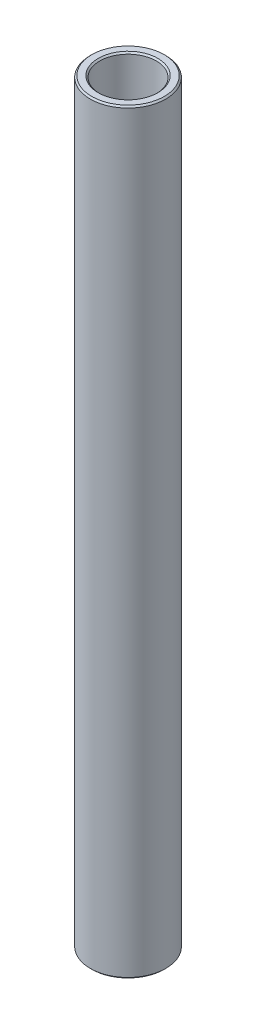
ISO-10303-21;
HEADER;
FILE_DESCRIPTION(('STEP AP214'),'2;1');
FILE_NAME('part.step','',(''),(''),'','','');
FILE_SCHEMA(('AUTOMOTIVE_DESIGN { 1 0 10303 214 1 1 1 1 }'));
ENDSEC;
DATA;
#1=APPLICATION_CONTEXT('core data for automotive mechanical design processes');
#2=APPLICATION_PROTOCOL_DEFINITION('international standard','automotive_design',2000,#1);
#3=PRODUCT_CONTEXT('',#1,'mechanical');
#4=PRODUCT('Part','Part','',(#3));
#5=PRODUCT_RELATED_PRODUCT_CATEGORY('part','',(#4));
#6=PRODUCT_DEFINITION_FORMATION('','',#4);
#7=PRODUCT_DEFINITION_CONTEXT('part definition',#1,'design');
#8=PRODUCT_DEFINITION('design','',#6,#7);
#9=PRODUCT_DEFINITION_SHAPE('','',#8);
#10=(LENGTH_UNIT() NAMED_UNIT(*) SI_UNIT(.MILLI.,.METRE.));
#11=(NAMED_UNIT(*) PLANE_ANGLE_UNIT() SI_UNIT($,.RADIAN.));
#12=(NAMED_UNIT(*) SI_UNIT($,.STERADIAN.) SOLID_ANGLE_UNIT());
#13=UNCERTAINTY_MEASURE_WITH_UNIT(LENGTH_MEASURE(1.E-05),#10,'distance_accuracy_value','');
#14=(GEOMETRIC_REPRESENTATION_CONTEXT(3) GLOBAL_UNCERTAINTY_ASSIGNED_CONTEXT((#13)) GLOBAL_UNIT_ASSIGNED_CONTEXT((#10,
#11,#12)) REPRESENTATION_CONTEXT('',''));
#15=CARTESIAN_POINT('',(0.,0.,0.));
#16=DIRECTION('',(0.,0.,1.));
#17=DIRECTION('',(1.,0.,0.));
#18=AXIS2_PLACEMENT_3D('',#15,#16,#17);
#19=CARTESIAN_POINT('',(6.35000000000029,70.6436949648141,0.));
#20=DIRECTION('',(0.,-1.,0.));
#21=DIRECTION('',(1.,0.,0.));
#22=AXIS2_PLACEMENT_3D('',#19,#20,#21);
#23=PLANE('',#22);
#24=CARTESIAN_POINT('',(0.,70.6436949648141,0.));
#25=DIRECTION('',(0.,-1.,0.));
#26=DIRECTION('',(1.,0.,0.));
#27=AXIS2_PLACEMENT_3D('',#24,#25,#26);
#28=CIRCLE('',#27,5.01649999999998);
#29=CARTESIAN_POINT('',(5.01649999999997,70.6436949648141,0.));
#30=VERTEX_POINT('',#29);
#31=EDGE_CURVE('E10',#30,#30,#28,.F.);
#32=ORIENTED_EDGE('',*,*,#31,.T.);
#33=EDGE_LOOP('',(#32));
#34=FACE_BOUND('',#33,.T.);
#35=CARTESIAN_POINT('',(0.,70.6436949648141,0.));
#36=DIRECTION('',(0.,-1.,0.));
#37=DIRECTION('',(1.,0.,0.));
#38=AXIS2_PLACEMENT_3D('',#35,#36,#37);
#39=CIRCLE('',#38,6.09600000000031);
#40=CARTESIAN_POINT('',(6.0960000000003,70.6436949648141,0.));
#41=VERTEX_POINT('',#40);
#42=EDGE_CURVE('E38',#41,#41,#39,.T.);
#43=ORIENTED_EDGE('',*,*,#42,.T.);
#44=EDGE_LOOP('',(#43));
#45=FACE_BOUND('',#44,.T.);
#46=ADVANCED_FACE('F31',(#34,#45),#23,.T.);
#47=CARTESIAN_POINT('',(0.,61.1186949648141,0.));
#48=DIRECTION('',(0.,-1.,0.));
#49=DIRECTION('',(1.,0.,0.));
#50=AXIS2_PLACEMENT_3D('',#47,#48,#49);
#51=CYLINDRICAL_SURFACE('',#50,4.76250000000008);
#52=CARTESIAN_POINT('',(-1.16547916277586E-13,197.576828412297,0.));
#53=DIRECTION('',(0.,1.,0.));
#54=DIRECTION('',(-1.,0.,0.));
#55=AXIS2_PLACEMENT_3D('',#52,#53,#54);
#56=CIRCLE('',#55,4.76250000000008);
#57=CARTESIAN_POINT('',(-4.76250000000019,197.576828412297,0.));
#58=VERTEX_POINT('',#57);
#59=EDGE_CURVE('E42',#58,#58,#56,.T.);
#60=ORIENTED_EDGE('',*,*,#59,.T.);
#61=EDGE_LOOP('',(#60));
#62=FACE_BOUND('',#61,.T.);
#63=CARTESIAN_POINT('',(0.,70.897694964814,0.));
#64=DIRECTION('',(0.,-1.,0.));
#65=DIRECTION('',(1.,0.,0.));
#66=AXIS2_PLACEMENT_3D('',#63,#64,#65);
#67=CIRCLE('',#66,4.76250000000008);
#68=CARTESIAN_POINT('',(4.76250000000007,70.897694964814,0.));
#69=VERTEX_POINT('',#68);
#70=EDGE_CURVE('E46',#69,#69,#67,.T.);
#71=ORIENTED_EDGE('',*,*,#70,.T.);
#72=EDGE_LOOP('',(#71));
#73=FACE_BOUND('',#72,.T.);
#74=ADVANCED_FACE('F75',(#62,#73),#51,.F.);
#75=CARTESIAN_POINT('',(4.76250000000001,197.830828412297,0.));
#76=DIRECTION('',(0.,1.,0.));
#77=DIRECTION('',(-1.,0.,0.));
#78=AXIS2_PLACEMENT_3D('',#75,#76,#77);
#79=PLANE('',#78);
#80=CARTESIAN_POINT('',(-1.16764855861813E-13,197.830828412297,0.));
#81=DIRECTION('',(0.,1.,0.));
#82=DIRECTION('',(-1.,0.,0.));
#83=AXIS2_PLACEMENT_3D('',#80,#81,#82);
#84=CIRCLE('',#83,6.09600000000043);
#85=CARTESIAN_POINT('',(-6.09600000000055,197.830828412297,0.));
#86=VERTEX_POINT('',#85);
#87=EDGE_CURVE('E51',#86,#86,#84,.T.);
#88=ORIENTED_EDGE('',*,*,#87,.T.);
#89=EDGE_LOOP('',(#88));
#90=FACE_BOUND('',#89,.T.);
#91=CARTESIAN_POINT('',(-1.16764855861813E-13,197.830828412297,0.));
#92=DIRECTION('',(0.,1.,0.));
#93=DIRECTION('',(-1.,0.,0.));
#94=AXIS2_PLACEMENT_3D('',#91,#92,#93);
#95=CIRCLE('',#94,5.01650000000014);
#96=CARTESIAN_POINT('',(-5.01650000000025,197.830828412297,0.));
#97=VERTEX_POINT('',#96);
#98=EDGE_CURVE('E54',#97,#97,#95,.F.);
#99=ORIENTED_EDGE('',*,*,#98,.T.);
#100=EDGE_LOOP('',(#99));
#101=FACE_BOUND('',#100,.T.);
#102=ADVANCED_FACE('F80',(#90,#101),#79,.T.);
#103=CARTESIAN_POINT('',(0.,61.1186949648141,0.));
#104=DIRECTION('',(0.,-1.,0.));
#105=DIRECTION('',(1.,0.,0.));
#106=AXIS2_PLACEMENT_3D('',#103,#104,#105);
#107=CYLINDRICAL_SURFACE('',#106,6.35000000000035);
#108=CARTESIAN_POINT('',(-1.16547916277586E-13,197.576828412297,0.));
#109=DIRECTION('',(0.,1.,0.));
#110=DIRECTION('',(-1.,0.,0.));
#111=AXIS2_PLACEMENT_3D('',#108,#109,#110);
#112=CIRCLE('',#111,6.35000000000035);
#113=CARTESIAN_POINT('',(-6.35000000000046,197.576828412297,0.));
#114=VERTEX_POINT('',#113);
#115=EDGE_CURVE('E57',#114,#114,#112,.F.);
#116=ORIENTED_EDGE('',*,*,#115,.T.);
#117=EDGE_LOOP('',(#116));
#118=FACE_BOUND('',#117,.T.);
#119=CARTESIAN_POINT('',(0.,70.8976949648141,0.));
#120=DIRECTION('',(0.,-1.,0.));
#121=DIRECTION('',(1.,0.,0.));
#122=AXIS2_PLACEMENT_3D('',#119,#120,#121);
#123=CIRCLE('',#122,6.35000000000035);
#124=CARTESIAN_POINT('',(6.35000000000034,70.8976949648141,0.));
#125=VERTEX_POINT('',#124);
#126=EDGE_CURVE('E60',#125,#125,#123,.F.);
#127=ORIENTED_EDGE('',*,*,#126,.T.);
#128=EDGE_LOOP('',(#127));
#129=FACE_BOUND('',#128,.T.);
#130=ADVANCED_FACE('F64',(#118,#129),#107,.T.);
#131=CARTESIAN_POINT('',(-1.16547916277586E-13,197.576828412297,0.));
#132=DIRECTION('',(0.,-1.,0.));
#133=DIRECTION('',(1.,0.,0.));
#134=AXIS2_PLACEMENT_3D('',#131,#132,#133);
#135=CONICAL_SURFACE('',#134,6.35000000000035,0.785398163397387);
#136=ORIENTED_EDGE('',*,*,#87,.F.);
#137=EDGE_LOOP('',(#136));
#138=FACE_BOUND('',#137,.T.);
#139=ORIENTED_EDGE('',*,*,#115,.F.);
#140=EDGE_LOOP('',(#139));
#141=FACE_BOUND('',#140,.T.);
#142=ADVANCED_FACE('F85',(#138,#141),#135,.T.);
#143=CARTESIAN_POINT('',(-1.16764855861813E-13,197.830828412297,0.));
#144=DIRECTION('',(0.,1.,0.));
#145=DIRECTION('',(-1.,0.,0.));
#146=AXIS2_PLACEMENT_3D('',#143,#144,#145);
#147=CONICAL_SURFACE('',#146,5.01650000000014,0.785398163397406);
#148=ORIENTED_EDGE('',*,*,#59,.F.);
#149=EDGE_LOOP('',(#148));
#150=FACE_BOUND('',#149,.T.);
#151=ORIENTED_EDGE('',*,*,#98,.F.);
#152=EDGE_LOOP('',(#151));
#153=FACE_BOUND('',#152,.T.);
#154=ADVANCED_FACE('F72',(#150,#153),#147,.F.);
#155=CARTESIAN_POINT('',(0.,70.897694964814,0.));
#156=DIRECTION('',(0.,-1.,0.));
#157=DIRECTION('',(1.,0.,0.));
#158=AXIS2_PLACEMENT_3D('',#155,#156,#157);
#159=CONICAL_SURFACE('',#158,4.76250000000008,0.785398163397436);
#160=ORIENTED_EDGE('',*,*,#31,.F.);
#161=EDGE_LOOP('',(#160));
#162=FACE_BOUND('',#161,.T.);
#163=ORIENTED_EDGE('',*,*,#70,.F.);
#164=EDGE_LOOP('',(#163));
#165=FACE_BOUND('',#164,.T.);
#166=ADVANCED_FACE('F68',(#162,#165),#159,.F.);
#167=CARTESIAN_POINT('',(0.,70.6436949648141,0.));
#168=DIRECTION('',(0.,1.,0.));
#169=DIRECTION('',(-1.,0.,0.));
#170=AXIS2_PLACEMENT_3D('',#167,#168,#169);
#171=CONICAL_SURFACE('',#170,6.09600000000031,0.785398163397426);
#172=ORIENTED_EDGE('',*,*,#126,.F.);
#173=EDGE_LOOP('',(#172));
#174=FACE_BOUND('',#173,.T.);
#175=ORIENTED_EDGE('',*,*,#42,.F.);
#176=EDGE_LOOP('',(#175));
#177=FACE_BOUND('',#176,.T.);
#178=ADVANCED_FACE('F33',(#174,#177),#171,.T.);
#179=CLOSED_SHELL('',(#46,#74,#102,#130,#142,#154,#166,#178));
#180=MANIFOLD_SOLID_BREP('B2',#179);
#181=ADVANCED_BREP_SHAPE_REPRESENTATION('',(#18,#180),#14);
#182=SHAPE_DEFINITION_REPRESENTATION(#9,#181);
ENDSEC;
END-ISO-10303-21;
